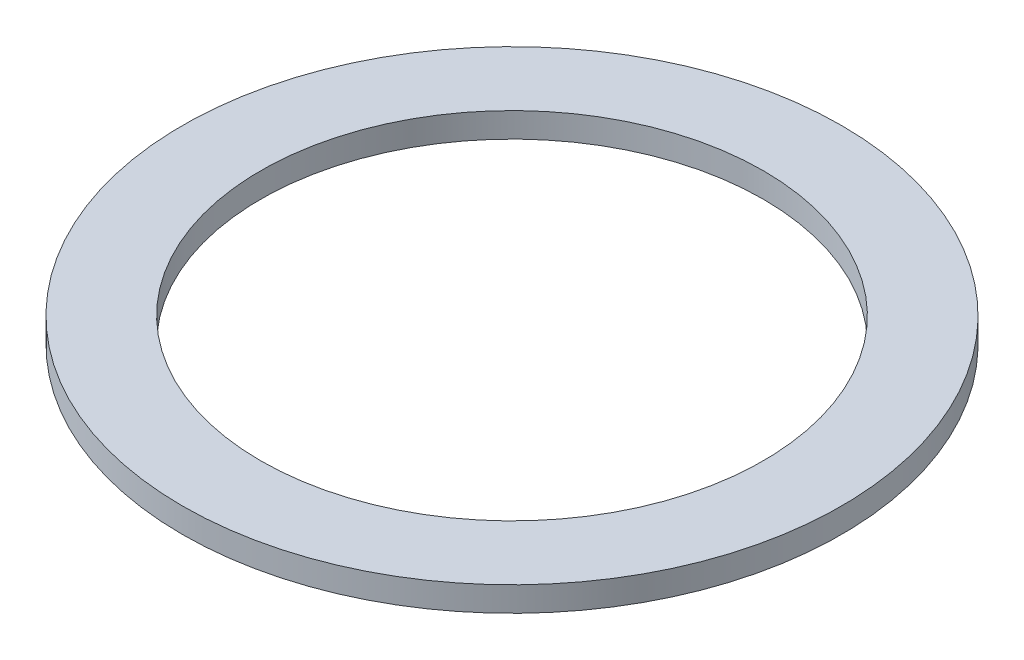
ISO-10303-21;
HEADER;
FILE_DESCRIPTION(('STEP AP214'),'2;1');
FILE_NAME('part.step','',(''),(''),'','','');
FILE_SCHEMA(('AUTOMOTIVE_DESIGN { 1 0 10303 214 1 1 1 1 }'));
ENDSEC;
DATA;
#1=APPLICATION_CONTEXT('core data for automotive mechanical design processes');
#2=APPLICATION_PROTOCOL_DEFINITION('international standard','automotive_design',2000,#1);
#3=PRODUCT_CONTEXT('',#1,'mechanical');
#4=PRODUCT('Part','Part','',(#3));
#5=PRODUCT_RELATED_PRODUCT_CATEGORY('part','',(#4));
#6=PRODUCT_DEFINITION_FORMATION('','',#4);
#7=PRODUCT_DEFINITION_CONTEXT('part definition',#1,'design');
#8=PRODUCT_DEFINITION('design','',#6,#7);
#9=PRODUCT_DEFINITION_SHAPE('','',#8);
#10=(LENGTH_UNIT() NAMED_UNIT(*) SI_UNIT(.MILLI.,.METRE.));
#11=(NAMED_UNIT(*) PLANE_ANGLE_UNIT() SI_UNIT($,.RADIAN.));
#12=(NAMED_UNIT(*) SI_UNIT($,.STERADIAN.) SOLID_ANGLE_UNIT());
#13=UNCERTAINTY_MEASURE_WITH_UNIT(LENGTH_MEASURE(1.E-05),#10,'distance_accuracy_value','');
#14=(GEOMETRIC_REPRESENTATION_CONTEXT(3) GLOBAL_UNCERTAINTY_ASSIGNED_CONTEXT((#13)) GLOBAL_UNIT_ASSIGNED_CONTEXT((#10,
#11,#12)) REPRESENTATION_CONTEXT('',''));
#15=CARTESIAN_POINT('',(0.,0.,0.));
#16=DIRECTION('',(0.,0.,1.));
#17=DIRECTION('',(1.,0.,0.));
#18=AXIS2_PLACEMENT_3D('',#15,#16,#17);
#19=CARTESIAN_POINT('',(0.,3.,0.));
#20=DIRECTION('',(0.,1.,0.));
#21=DIRECTION('',(0.,0.,1.));
#22=AXIS2_PLACEMENT_3D('',#19,#20,#21);
#23=PLANE('',#22);
#24=CARTESIAN_POINT('',(0.,3.,0.));
#25=DIRECTION('',(0.,1.,0.));
#26=DIRECTION('',(0.,0.,1.));
#27=AXIS2_PLACEMENT_3D('',#24,#25,#26);
#28=CIRCLE('',#27,30.5);
#29=CARTESIAN_POINT('',(0.,3.,30.5));
#30=VERTEX_POINT('',#29);
#31=EDGE_CURVE('E27',#30,#30,#28,.F.);
#32=ORIENTED_EDGE('',*,*,#31,.T.);
#33=EDGE_LOOP('',(#32));
#34=FACE_BOUND('',#33,.T.);
#35=CARTESIAN_POINT('',(0.,3.,0.));
#36=DIRECTION('',(0.,1.,0.));
#37=DIRECTION('',(0.,0.,1.));
#38=AXIS2_PLACEMENT_3D('',#35,#36,#37);
#39=CIRCLE('',#38,40.);
#40=CARTESIAN_POINT('',(0.,3.,40.));
#41=VERTEX_POINT('',#40);
#42=EDGE_CURVE('E18',#41,#41,#39,.F.);
#43=ORIENTED_EDGE('',*,*,#42,.F.);
#44=EDGE_LOOP('',(#43));
#45=FACE_BOUND('',#44,.T.);
#46=ADVANCED_FACE('F15',(#34,#45),#23,.T.);
#47=CARTESIAN_POINT('',(0.,0.,0.));
#48=DIRECTION('',(0.,1.,0.));
#49=DIRECTION('',(0.,0.,1.));
#50=AXIS2_PLACEMENT_3D('',#47,#48,#49);
#51=CYLINDRICAL_SURFACE('',#50,40.);
#52=ORIENTED_EDGE('',*,*,#42,.T.);
#53=EDGE_LOOP('',(#52));
#54=FACE_BOUND('',#53,.T.);
#55=CARTESIAN_POINT('',(0.,0.,0.));
#56=DIRECTION('',(0.,1.,0.));
#57=DIRECTION('',(0.,0.,1.));
#58=AXIS2_PLACEMENT_3D('',#55,#56,#57);
#59=CIRCLE('',#58,40.);
#60=CARTESIAN_POINT('',(0.,0.,40.));
#61=VERTEX_POINT('',#60);
#62=EDGE_CURVE('E22',#61,#61,#59,.T.);
#63=ORIENTED_EDGE('',*,*,#62,.T.);
#64=EDGE_LOOP('',(#63));
#65=FACE_BOUND('',#64,.T.);
#66=ADVANCED_FACE('F35',(#54,#65),#51,.T.);
#67=CARTESIAN_POINT('',(0.,0.,0.));
#68=DIRECTION('',(0.,1.,0.));
#69=DIRECTION('',(0.,0.,1.));
#70=AXIS2_PLACEMENT_3D('',#67,#68,#69);
#71=CYLINDRICAL_SURFACE('',#70,30.5);
#72=ORIENTED_EDGE('',*,*,#31,.F.);
#73=EDGE_LOOP('',(#72));
#74=FACE_BOUND('',#73,.T.);
#75=CARTESIAN_POINT('',(0.,0.,0.));
#76=DIRECTION('',(0.,1.,0.));
#77=DIRECTION('',(0.,0.,1.));
#78=AXIS2_PLACEMENT_3D('',#75,#76,#77);
#79=CIRCLE('',#78,30.5);
#80=CARTESIAN_POINT('',(0.,0.,30.5));
#81=VERTEX_POINT('',#80);
#82=EDGE_CURVE('E10',#81,#81,#79,.F.);
#83=ORIENTED_EDGE('',*,*,#82,.T.);
#84=EDGE_LOOP('',(#83));
#85=FACE_BOUND('',#84,.T.);
#86=ADVANCED_FACE('F43',(#74,#85),#71,.F.);
#87=CARTESIAN_POINT('',(0.,0.,0.));
#88=DIRECTION('',(0.,1.,0.));
#89=DIRECTION('',(0.,0.,1.));
#90=AXIS2_PLACEMENT_3D('',#87,#88,#89);
#91=PLANE('',#90);
#92=ORIENTED_EDGE('',*,*,#82,.F.);
#93=EDGE_LOOP('',(#92));
#94=FACE_BOUND('',#93,.T.);
#95=ORIENTED_EDGE('',*,*,#62,.F.);
#96=EDGE_LOOP('',(#95));
#97=FACE_BOUND('',#96,.T.);
#98=ADVANCED_FACE('F44',(#94,#97),#91,.F.);
#99=CLOSED_SHELL('',(#46,#66,#86,#98));
#100=MANIFOLD_SOLID_BREP('B1',#99);
#101=ADVANCED_BREP_SHAPE_REPRESENTATION('',(#18,#100),#14);
#102=SHAPE_DEFINITION_REPRESENTATION(#9,#101);
ENDSEC;
END-ISO-10303-21;
